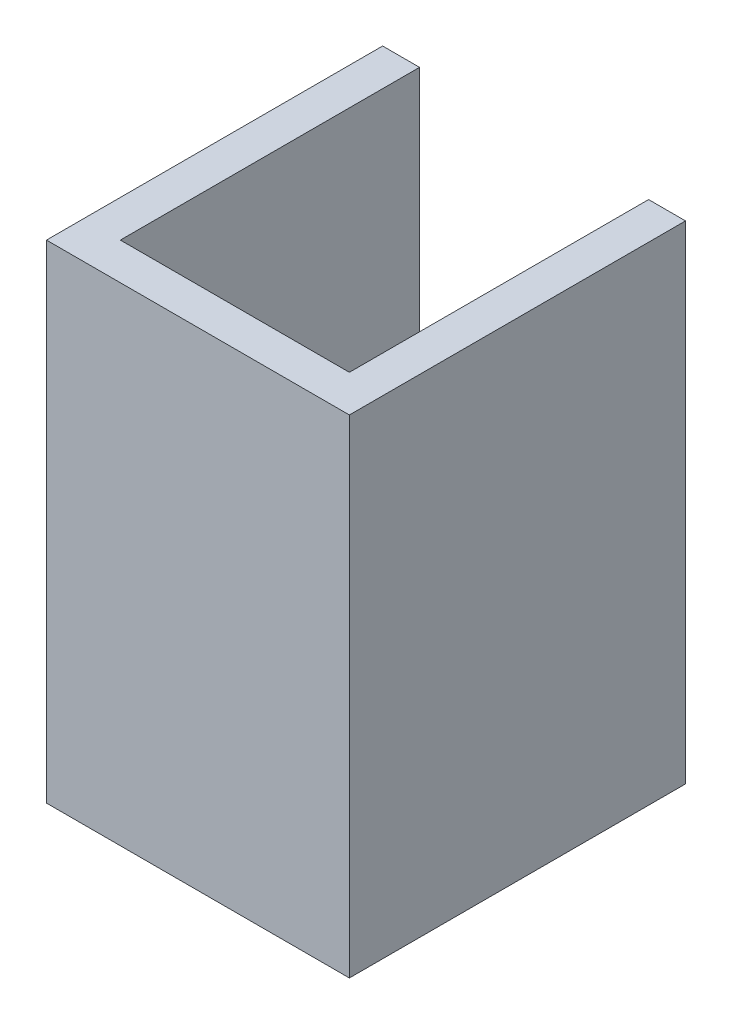
ISO-10303-21;
HEADER;
FILE_DESCRIPTION(('STEP AP214'),'2;1');
FILE_NAME('part.step','',(''),(''),'','','');
FILE_SCHEMA(('AUTOMOTIVE_DESIGN { 1 0 10303 214 1 1 1 1 }'));
ENDSEC;
DATA;
#1=APPLICATION_CONTEXT('core data for automotive mechanical design processes');
#2=APPLICATION_PROTOCOL_DEFINITION('international standard','automotive_design',2000,#1);
#3=PRODUCT_CONTEXT('',#1,'mechanical');
#4=PRODUCT('Part','Part','',(#3));
#5=PRODUCT_RELATED_PRODUCT_CATEGORY('part','',(#4));
#6=PRODUCT_DEFINITION_FORMATION('','',#4);
#7=PRODUCT_DEFINITION_CONTEXT('part definition',#1,'design');
#8=PRODUCT_DEFINITION('design','',#6,#7);
#9=PRODUCT_DEFINITION_SHAPE('','',#8);
#10=(LENGTH_UNIT() NAMED_UNIT(*) SI_UNIT(.MILLI.,.METRE.));
#11=(NAMED_UNIT(*) PLANE_ANGLE_UNIT() SI_UNIT($,.RADIAN.));
#12=(NAMED_UNIT(*) SI_UNIT($,.STERADIAN.) SOLID_ANGLE_UNIT());
#13=UNCERTAINTY_MEASURE_WITH_UNIT(LENGTH_MEASURE(1.E-05),#10,'distance_accuracy_value','');
#14=(GEOMETRIC_REPRESENTATION_CONTEXT(3) GLOBAL_UNCERTAINTY_ASSIGNED_CONTEXT((#13)) GLOBAL_UNIT_ASSIGNED_CONTEXT((#10,
#11,#12)) REPRESENTATION_CONTEXT('',''));
#15=CARTESIAN_POINT('',(0.,0.,0.));
#16=DIRECTION('',(0.,0.,1.));
#17=DIRECTION('',(1.,0.,0.));
#18=AXIS2_PLACEMENT_3D('',#15,#16,#17);
#19=CARTESIAN_POINT('',(4.39549320129841,0.,16.2));
#20=DIRECTION('',(-1.,0.,0.));
#21=DIRECTION('',(0.,-1.,0.));
#22=AXIS2_PLACEMENT_3D('',#19,#20,#21);
#23=PLANE('',#22);
#24=DIRECTION('',(0.,1.,0.));
#25=VECTOR('',#24,1.);
#26=CARTESIAN_POINT('',(4.39549320129841,0.,0.));
#27=LINE('',#26,#25);
#28=CARTESIAN_POINT('',(4.3954932012984,-8.37706703686108,0.));
#29=VERTEX_POINT('',#28);
#30=CARTESIAN_POINT('',(4.3954932012984,16.0229329631389,0.));
#31=VERTEX_POINT('',#30);
#32=EDGE_CURVE('E111',#29,#31,#27,.T.);
#33=ORIENTED_EDGE('',*,*,#32,.F.);
#34=DIRECTION('',(0.,0.,-1.));
#35=VECTOR('',#34,1.);
#36=CARTESIAN_POINT('',(4.3954932012984,-8.37706703686108,16.2));
#37=LINE('',#36,#35);
#38=CARTESIAN_POINT('',(4.3954932012984,-8.37706703686108,16.2));
#39=VERTEX_POINT('',#38);
#40=EDGE_CURVE('E11',#39,#29,#37,.T.);
#41=ORIENTED_EDGE('',*,*,#40,.F.);
#42=DIRECTION('',(0.,1.,0.));
#43=VECTOR('',#42,1.);
#44=CARTESIAN_POINT('',(4.39549320129841,0.,16.2));
#45=LINE('',#44,#43);
#46=CARTESIAN_POINT('',(4.3954932012984,16.0229329631389,16.2));
#47=VERTEX_POINT('',#46);
#48=EDGE_CURVE('E112',#39,#47,#45,.T.);
#49=ORIENTED_EDGE('',*,*,#48,.T.);
#50=DIRECTION('',(0.,0.,-1.));
#51=VECTOR('',#50,1.);
#52=CARTESIAN_POINT('',(4.3954932012984,16.0229329631389,16.2));
#53=LINE('',#52,#51);
#54=EDGE_CURVE('E102',#47,#31,#53,.T.);
#55=ORIENTED_EDGE('',*,*,#54,.T.);
#56=EDGE_LOOP('',(#33,#41,#49,#55));
#57=FACE_BOUND('',#56,.T.);
#58=ADVANCED_FACE('F43',(#57),#23,.T.);
#59=CARTESIAN_POINT('',(0.,-8.37706703686108,16.2));
#60=DIRECTION('',(0.,1.,0.));
#61=DIRECTION('',(0.,0.,1.));
#62=AXIS2_PLACEMENT_3D('',#59,#60,#61);
#63=PLANE('',#62);
#64=DIRECTION('',(1.,0.,0.));
#65=VECTOR('',#64,1.);
#66=CARTESIAN_POINT('',(0.,-8.37706703686108,0.));
#67=LINE('',#66,#65);
#68=CARTESIAN_POINT('',(-8.0045067987016,-8.37706703686108,0.));
#69=VERTEX_POINT('',#68);
#70=EDGE_CURVE('E141',#69,#29,#67,.T.);
#71=ORIENTED_EDGE('',*,*,#70,.F.);
#72=DIRECTION('',(0.,0.,-1.));
#73=VECTOR('',#72,1.);
#74=CARTESIAN_POINT('',(-8.0045067987016,-8.37706703686108,16.2));
#75=LINE('',#74,#73);
#76=CARTESIAN_POINT('',(-8.0045067987016,-8.37706703686108,16.2));
#77=VERTEX_POINT('',#76);
#78=EDGE_CURVE('E51',#77,#69,#75,.T.);
#79=ORIENTED_EDGE('',*,*,#78,.F.);
#80=DIRECTION('',(1.,0.,0.));
#81=VECTOR('',#80,1.);
#82=CARTESIAN_POINT('',(0.,-8.37706703686108,16.2));
#83=LINE('',#82,#81);
#84=EDGE_CURVE('E58',#77,#39,#83,.T.);
#85=ORIENTED_EDGE('',*,*,#84,.T.);
#86=ORIENTED_EDGE('',*,*,#40,.T.);
#87=EDGE_LOOP('',(#71,#79,#85,#86));
#88=FACE_BOUND('',#87,.T.);
#89=ADVANCED_FACE('F142',(#88),#63,.T.);
#90=CARTESIAN_POINT('',(-8.0045067987016,0.,16.2));
#91=DIRECTION('',(1.,0.,0.));
#92=DIRECTION('',(0.,1.,0.));
#93=AXIS2_PLACEMENT_3D('',#90,#91,#92);
#94=PLANE('',#93);
#95=DIRECTION('',(0.,-1.,0.));
#96=VECTOR('',#95,1.);
#97=CARTESIAN_POINT('',(-8.0045067987016,0.,0.));
#98=LINE('',#97,#96);
#99=CARTESIAN_POINT('',(-8.0045067987016,16.0229329631389,0.));
#100=VERTEX_POINT('',#99);
#101=EDGE_CURVE('E138',#100,#69,#98,.T.);
#102=ORIENTED_EDGE('',*,*,#101,.F.);
#103=DIRECTION('',(0.,0.,-1.));
#104=VECTOR('',#103,1.);
#105=CARTESIAN_POINT('',(-8.0045067987016,16.0229329631389,16.2));
#106=LINE('',#105,#104);
#107=CARTESIAN_POINT('',(-8.0045067987016,16.0229329631389,16.2));
#108=VERTEX_POINT('',#107);
#109=EDGE_CURVE('E130',#108,#100,#106,.T.);
#110=ORIENTED_EDGE('',*,*,#109,.F.);
#111=DIRECTION('',(0.,-1.,0.));
#112=VECTOR('',#111,1.);
#113=CARTESIAN_POINT('',(-8.0045067987016,0.,16.2));
#114=LINE('',#113,#112);
#115=EDGE_CURVE('E123',#108,#77,#114,.T.);
#116=ORIENTED_EDGE('',*,*,#115,.T.);
#117=ORIENTED_EDGE('',*,*,#78,.T.);
#118=EDGE_LOOP('',(#102,#110,#116,#117));
#119=FACE_BOUND('',#118,.T.);
#120=ADVANCED_FACE('F135',(#119),#94,.T.);
#121=CARTESIAN_POINT('',(-10.0045067987016,0.,16.2));
#122=DIRECTION('',(-1.,0.,0.));
#123=DIRECTION('',(0.,0.,1.));
#124=AXIS2_PLACEMENT_3D('',#121,#122,#123);
#125=PLANE('',#124);
#126=DIRECTION('',(0.,1.,0.));
#127=VECTOR('',#126,1.);
#128=CARTESIAN_POINT('',(-10.0045067987016,0.,0.));
#129=LINE('',#128,#127);
#130=CARTESIAN_POINT('',(-10.0045067987016,-10.3770670368611,0.));
#131=VERTEX_POINT('',#130);
#132=CARTESIAN_POINT('',(-10.0045067987016,16.0229329631389,0.));
#133=VERTEX_POINT('',#132);
#134=EDGE_CURVE('E119',#131,#133,#129,.T.);
#135=ORIENTED_EDGE('',*,*,#134,.F.);
#136=DIRECTION('',(0.,0.,-1.));
#137=VECTOR('',#136,1.);
#138=CARTESIAN_POINT('',(-10.0045067987016,-10.3770670368611,16.2));
#139=LINE('',#138,#137);
#140=CARTESIAN_POINT('',(-10.0045067987016,-10.3770670368611,18.2));
#141=VERTEX_POINT('',#140);
#142=EDGE_CURVE('E126',#141,#131,#139,.T.);
#143=ORIENTED_EDGE('',*,*,#142,.F.);
#144=DIRECTION('',(0.,1.,0.));
#145=VECTOR('',#144,1.);
#146=CARTESIAN_POINT('',(-10.0045067987016,-10.3770670368611,18.2));
#147=LINE('',#146,#145);
#148=CARTESIAN_POINT('',(-10.0045067987016,16.0229329631389,18.2));
#149=VERTEX_POINT('',#148);
#150=EDGE_CURVE('E159',#141,#149,#147,.T.);
#151=ORIENTED_EDGE('',*,*,#150,.T.);
#152=DIRECTION('',(0.,0.,-1.));
#153=VECTOR('',#152,1.);
#154=CARTESIAN_POINT('',(-10.0045067987016,16.0229329631389,16.2));
#155=LINE('',#154,#153);
#156=EDGE_CURVE('E128',#149,#133,#155,.T.);
#157=ORIENTED_EDGE('',*,*,#156,.T.);
#158=EDGE_LOOP('',(#135,#143,#151,#157));
#159=FACE_BOUND('',#158,.T.);
#160=ADVANCED_FACE('F154',(#159),#125,.T.);
#161=CARTESIAN_POINT('',(0.,-10.3770670368611,16.2));
#162=DIRECTION('',(0.,1.,0.));
#163=DIRECTION('',(0.,0.,1.));
#164=AXIS2_PLACEMENT_3D('',#161,#162,#163);
#165=PLANE('',#164);
#166=DIRECTION('',(1.,0.,0.));
#167=VECTOR('',#166,1.);
#168=CARTESIAN_POINT('',(0.,-10.3770670368611,0.));
#169=LINE('',#168,#167);
#170=CARTESIAN_POINT('',(6.3954932012984,-10.3770670368611,0.));
#171=VERTEX_POINT('',#170);
#172=EDGE_CURVE('E117',#131,#171,#169,.T.);
#173=ORIENTED_EDGE('',*,*,#172,.T.);
#174=DIRECTION('',(0.,0.,-1.));
#175=VECTOR('',#174,1.);
#176=CARTESIAN_POINT('',(6.3954932012984,-10.3770670368611,16.2));
#177=LINE('',#176,#175);
#178=CARTESIAN_POINT('',(6.3954932012984,-10.3770670368611,18.2));
#179=VERTEX_POINT('',#178);
#180=EDGE_CURVE('E101',#179,#171,#177,.T.);
#181=ORIENTED_EDGE('',*,*,#180,.F.);
#182=DIRECTION('',(-1.,0.,0.));
#183=VECTOR('',#182,1.);
#184=CARTESIAN_POINT('',(6.3954932012984,-10.3770670368611,18.2));
#185=LINE('',#184,#183);
#186=EDGE_CURVE('E175',#179,#141,#185,.T.);
#187=ORIENTED_EDGE('',*,*,#186,.T.);
#188=ORIENTED_EDGE('',*,*,#142,.T.);
#189=EDGE_LOOP('',(#173,#181,#187,#188));
#190=FACE_BOUND('',#189,.T.);
#191=ADVANCED_FACE('F174',(#190),#165,.F.);
#192=CARTESIAN_POINT('',(6.3954932012984,0.,16.2));
#193=DIRECTION('',(1.,0.,0.));
#194=DIRECTION('',(0.,0.,-1.));
#195=AXIS2_PLACEMENT_3D('',#192,#193,#194);
#196=PLANE('',#195);
#197=DIRECTION('',(0.,-1.,0.));
#198=VECTOR('',#197,1.);
#199=CARTESIAN_POINT('',(6.3954932012984,0.,0.));
#200=LINE('',#199,#198);
#201=CARTESIAN_POINT('',(6.3954932012984,16.0229329631389,0.));
#202=VERTEX_POINT('',#201);
#203=EDGE_CURVE('E108',#202,#171,#200,.T.);
#204=ORIENTED_EDGE('',*,*,#203,.F.);
#205=DIRECTION('',(0.,0.,-1.));
#206=VECTOR('',#205,1.);
#207=CARTESIAN_POINT('',(6.3954932012984,16.0229329631389,16.2));
#208=LINE('',#207,#206);
#209=CARTESIAN_POINT('',(6.3954932012984,16.0229329631389,18.2));
#210=VERTEX_POINT('',#209);
#211=EDGE_CURVE('E87',#210,#202,#208,.T.);
#212=ORIENTED_EDGE('',*,*,#211,.F.);
#213=DIRECTION('',(0.,-1.,0.));
#214=VECTOR('',#213,1.);
#215=CARTESIAN_POINT('',(6.3954932012984,16.0229329631389,18.2));
#216=LINE('',#215,#214);
#217=EDGE_CURVE('E178',#210,#179,#216,.T.);
#218=ORIENTED_EDGE('',*,*,#217,.T.);
#219=ORIENTED_EDGE('',*,*,#180,.T.);
#220=EDGE_LOOP('',(#204,#212,#218,#219));
#221=FACE_BOUND('',#220,.T.);
#222=ADVANCED_FACE('F114',(#221),#196,.T.);
#223=CARTESIAN_POINT('',(0.,16.0229329631389,16.2));
#224=DIRECTION('',(0.,-1.,0.));
#225=DIRECTION('',(0.,0.,-1.));
#226=AXIS2_PLACEMENT_3D('',#223,#224,#225);
#227=PLANE('',#226);
#228=DIRECTION('',(-1.,0.,0.));
#229=VECTOR('',#228,1.);
#230=CARTESIAN_POINT('',(0.,16.0229329631389,0.));
#231=LINE('',#230,#229);
#232=EDGE_CURVE('E91',#202,#31,#231,.T.);
#233=ORIENTED_EDGE('',*,*,#232,.T.);
#234=ORIENTED_EDGE('',*,*,#54,.F.);
#235=DIRECTION('',(1.,0.,0.));
#236=VECTOR('',#235,1.);
#237=CARTESIAN_POINT('',(-10.0045067987016,16.0229329631389,16.2));
#238=LINE('',#237,#236);
#239=EDGE_CURVE('E163',#108,#47,#238,.T.);
#240=ORIENTED_EDGE('',*,*,#239,.F.);
#241=ORIENTED_EDGE('',*,*,#109,.T.);
#242=DIRECTION('',(1.,0.,0.));
#243=VECTOR('',#242,1.);
#244=CARTESIAN_POINT('',(0.,16.0229329631389,0.));
#245=LINE('',#244,#243);
#246=EDGE_CURVE('E147',#133,#100,#245,.T.);
#247=ORIENTED_EDGE('',*,*,#246,.F.);
#248=ORIENTED_EDGE('',*,*,#156,.F.);
#249=DIRECTION('',(1.,0.,0.));
#250=VECTOR('',#249,1.);
#251=CARTESIAN_POINT('',(-10.0045067987016,16.0229329631389,18.2));
#252=LINE('',#251,#250);
#253=EDGE_CURVE('E96',#149,#210,#252,.T.);
#254=ORIENTED_EDGE('',*,*,#253,.T.);
#255=ORIENTED_EDGE('',*,*,#211,.T.);
#256=EDGE_LOOP('',(#233,#234,#240,#241,#247,#248,#254,#255));
#257=FACE_BOUND('',#256,.T.);
#258=ADVANCED_FACE('F89',(#257),#227,.F.);
#259=CARTESIAN_POINT('',(0.,0.,0.));
#260=DIRECTION('',(0.,0.,1.));
#261=DIRECTION('',(1.,0.,0.));
#262=AXIS2_PLACEMENT_3D('',#259,#260,#261);
#263=PLANE('',#262);
#264=ORIENTED_EDGE('',*,*,#32,.T.);
#265=ORIENTED_EDGE('',*,*,#232,.F.);
#266=ORIENTED_EDGE('',*,*,#203,.T.);
#267=ORIENTED_EDGE('',*,*,#172,.F.);
#268=ORIENTED_EDGE('',*,*,#134,.T.);
#269=ORIENTED_EDGE('',*,*,#246,.T.);
#270=ORIENTED_EDGE('',*,*,#101,.T.);
#271=ORIENTED_EDGE('',*,*,#70,.T.);
#272=EDGE_LOOP('',(#264,#265,#266,#267,#268,#269,#270,#271));
#273=FACE_BOUND('',#272,.T.);
#274=ADVANCED_FACE('F106',(#273),#263,.F.);
#275=CARTESIAN_POINT('',(0.,0.,16.2));
#276=DIRECTION('',(0.,0.,-1.));
#277=DIRECTION('',(-1.,0.,0.));
#278=AXIS2_PLACEMENT_3D('',#275,#276,#277);
#279=PLANE('',#278);
#280=ORIENTED_EDGE('',*,*,#48,.F.);
#281=ORIENTED_EDGE('',*,*,#84,.F.);
#282=ORIENTED_EDGE('',*,*,#115,.F.);
#283=ORIENTED_EDGE('',*,*,#239,.T.);
#284=EDGE_LOOP('',(#280,#281,#282,#283));
#285=FACE_BOUND('',#284,.T.);
#286=ADVANCED_FACE('F188',(#285),#279,.T.);
#287=CARTESIAN_POINT('',(0.,0.,18.2));
#288=DIRECTION('',(0.,0.,-1.));
#289=DIRECTION('',(-1.,0.,0.));
#290=AXIS2_PLACEMENT_3D('',#287,#288,#289);
#291=PLANE('',#290);
#292=ORIENTED_EDGE('',*,*,#186,.F.);
#293=ORIENTED_EDGE('',*,*,#217,.F.);
#294=ORIENTED_EDGE('',*,*,#253,.F.);
#295=ORIENTED_EDGE('',*,*,#150,.F.);
#296=EDGE_LOOP('',(#292,#293,#294,#295));
#297=FACE_BOUND('',#296,.T.);
#298=ADVANCED_FACE('F177',(#297),#291,.F.);
#299=CLOSED_SHELL('',(#58,#89,#120,#160,#191,#222,#258,#274,#286,#298));
#300=MANIFOLD_SOLID_BREP('B2',#299);
#301=ADVANCED_BREP_SHAPE_REPRESENTATION('',(#18,#300),#14);
#302=SHAPE_DEFINITION_REPRESENTATION(#9,#301);
ENDSEC;
END-ISO-10303-21;
